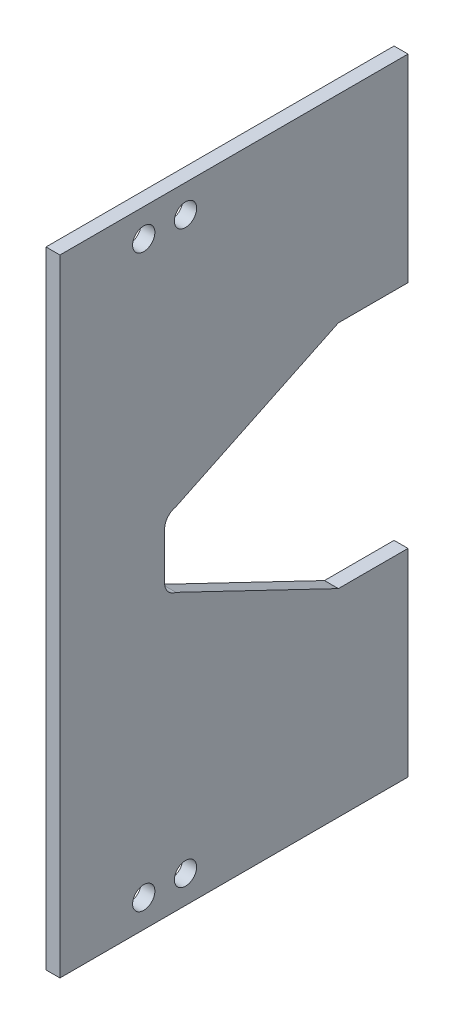
ISO-10303-21;
HEADER;
FILE_DESCRIPTION(('STEP AP214'),'2;1');
FILE_NAME('part.step','',(''),(''),'','','');
FILE_SCHEMA(('AUTOMOTIVE_DESIGN { 1 0 10303 214 1 1 1 1 }'));
ENDSEC;
DATA;
#1=APPLICATION_CONTEXT('core data for automotive mechanical design processes');
#2=APPLICATION_PROTOCOL_DEFINITION('international standard','automotive_design',2000,#1);
#3=PRODUCT_CONTEXT('',#1,'mechanical');
#4=PRODUCT('Part','Part','',(#3));
#5=PRODUCT_RELATED_PRODUCT_CATEGORY('part','',(#4));
#6=PRODUCT_DEFINITION_FORMATION('','',#4);
#7=PRODUCT_DEFINITION_CONTEXT('part definition',#1,'design');
#8=PRODUCT_DEFINITION('design','',#6,#7);
#9=PRODUCT_DEFINITION_SHAPE('','',#8);
#10=(LENGTH_UNIT() NAMED_UNIT(*) SI_UNIT(.MILLI.,.METRE.));
#11=(NAMED_UNIT(*) PLANE_ANGLE_UNIT() SI_UNIT($,.RADIAN.));
#12=(NAMED_UNIT(*) SI_UNIT($,.STERADIAN.) SOLID_ANGLE_UNIT());
#13=UNCERTAINTY_MEASURE_WITH_UNIT(LENGTH_MEASURE(1.E-05),#10,'distance_accuracy_value','');
#14=(GEOMETRIC_REPRESENTATION_CONTEXT(3) GLOBAL_UNCERTAINTY_ASSIGNED_CONTEXT((#13)) GLOBAL_UNIT_ASSIGNED_CONTEXT((#10,
#11,#12)) REPRESENTATION_CONTEXT('',''));
#15=CARTESIAN_POINT('',(0.,0.,0.));
#16=DIRECTION('',(0.,0.,1.));
#17=DIRECTION('',(1.,0.,0.));
#18=AXIS2_PLACEMENT_3D('',#15,#16,#17);
#19=CARTESIAN_POINT('',(1.20625,-10.795,3.));
#20=DIRECTION('',(0.,1.,0.));
#21=DIRECTION('',(0.,0.,1.));
#22=AXIS2_PLACEMENT_3D('',#19,#20,#21);
#23=PLANE('',#22);
#24=DIRECTION('',(0.,0.,-1.));
#25=VECTOR('',#24,1.);
#26=CARTESIAN_POINT('',(-0.793750000000003,-10.795,3.));
#27=LINE('',#26,#25);
#28=CARTESIAN_POINT('',(-0.793750000000006,-10.795,15.));
#29=VERTEX_POINT('',#28);
#30=CARTESIAN_POINT('',(-0.793749999999991,-10.795,-35.));
#31=VERTEX_POINT('',#30);
#32=EDGE_CURVE('E246',#29,#31,#27,.T.);
#33=ORIENTED_EDGE('',*,*,#32,.F.);
#34=DIRECTION('',(-1.,0.,0.));
#35=VECTOR('',#34,1.);
#36=CARTESIAN_POINT('',(1.20624999999999,-10.795,15.));
#37=LINE('',#36,#35);
#38=CARTESIAN_POINT('',(1.20624999999999,-10.795,15.));
#39=VERTEX_POINT('',#38);
#40=EDGE_CURVE('E140',#39,#29,#37,.T.);
#41=ORIENTED_EDGE('',*,*,#40,.F.);
#42=DIRECTION('',(0.,0.,-1.));
#43=VECTOR('',#42,1.);
#44=CARTESIAN_POINT('',(1.20625,-10.795,3.));
#45=LINE('',#44,#43);
#46=CARTESIAN_POINT('',(1.20625000000001,-10.795,-35.));
#47=VERTEX_POINT('',#46);
#48=EDGE_CURVE('E135',#39,#47,#45,.T.);
#49=ORIENTED_EDGE('',*,*,#48,.T.);
#50=DIRECTION('',(-1.,0.,0.));
#51=VECTOR('',#50,1.);
#52=CARTESIAN_POINT('',(1.20625000000001,-10.795,-35.));
#53=LINE('',#52,#51);
#54=EDGE_CURVE('E137',#47,#31,#53,.T.);
#55=ORIENTED_EDGE('',*,*,#54,.T.);
#56=EDGE_LOOP('',(#33,#41,#49,#55));
#57=FACE_BOUND('',#56,.T.);
#58=ADVANCED_FACE('F39',(#57),#23,.T.);
#59=CARTESIAN_POINT('',(1.20625,-100.745,3.));
#60=DIRECTION('',(0.,-1.,0.));
#61=DIRECTION('',(0.,0.,-1.));
#62=AXIS2_PLACEMENT_3D('',#59,#60,#61);
#63=PLANE('',#62);
#64=DIRECTION('',(0.,0.,1.));
#65=VECTOR('',#64,1.);
#66=CARTESIAN_POINT('',(-0.793750000000003,-100.745,3.));
#67=LINE('',#66,#65);
#68=CARTESIAN_POINT('',(-0.793749999999991,-100.745,-35.));
#69=VERTEX_POINT('',#68);
#70=CARTESIAN_POINT('',(-0.793750000000006,-100.745,15.));
#71=VERTEX_POINT('',#70);
#72=EDGE_CURVE('E252',#69,#71,#67,.T.);
#73=ORIENTED_EDGE('',*,*,#72,.F.);
#74=DIRECTION('',(-1.,0.,0.));
#75=VECTOR('',#74,1.);
#76=CARTESIAN_POINT('',(1.20625000000001,-100.745,-35.));
#77=LINE('',#76,#75);
#78=CARTESIAN_POINT('',(1.20625000000001,-100.745,-35.));
#79=VERTEX_POINT('',#78);
#80=EDGE_CURVE('E192',#79,#69,#77,.T.);
#81=ORIENTED_EDGE('',*,*,#80,.F.);
#82=DIRECTION('',(0.,0.,1.));
#83=VECTOR('',#82,1.);
#84=CARTESIAN_POINT('',(1.20625,-100.745,3.));
#85=LINE('',#84,#83);
#86=CARTESIAN_POINT('',(1.20624999999999,-100.745,15.));
#87=VERTEX_POINT('',#86);
#88=EDGE_CURVE('E146',#79,#87,#85,.T.);
#89=ORIENTED_EDGE('',*,*,#88,.T.);
#90=DIRECTION('',(-1.,0.,0.));
#91=VECTOR('',#90,1.);
#92=CARTESIAN_POINT('',(1.20624999999999,-100.745,15.));
#93=LINE('',#92,#91);
#94=EDGE_CURVE('E236',#87,#71,#93,.T.);
#95=ORIENTED_EDGE('',*,*,#94,.T.);
#96=EDGE_LOOP('',(#73,#81,#89,#95));
#97=FACE_BOUND('',#96,.T.);
#98=ADVANCED_FACE('F331',(#97),#63,.T.);
#99=CARTESIAN_POINT('',(1.20625,-55.77,-0.0391447555514948));
#100=DIRECTION('',(0.,0.,-1.));
#101=DIRECTION('',(-1.,0.,0.));
#102=AXIS2_PLACEMENT_3D('',#99,#100,#101);
#103=PLANE('',#102);
#104=DIRECTION('',(0.,-1.,0.));
#105=VECTOR('',#104,1.);
#106=CARTESIAN_POINT('',(1.20625,-55.77,-0.0391447555514948));
#107=LINE('',#106,#105);
#108=CARTESIAN_POINT('',(1.20625,-52.4114543338415,-0.0391447555514952));
#109=VERTEX_POINT('',#108);
#110=CARTESIAN_POINT('',(1.20625,-59.1285456661585,-0.0391447555514944));
#111=VERTEX_POINT('',#110);
#112=EDGE_CURVE('E243',#109,#111,#107,.T.);
#113=ORIENTED_EDGE('',*,*,#112,.T.);
#114=DIRECTION('',(-1.,0.,0.));
#115=VECTOR('',#114,1.);
#116=CARTESIAN_POINT('',(-0.793750000000001,-59.1285456661585,-0.0391447555514954));
#117=LINE('',#116,#115);
#118=CARTESIAN_POINT('',(-0.793750000000002,-59.1285456661585,-0.0391447555514954));
#119=VERTEX_POINT('',#118);
#120=EDGE_CURVE('E268',#111,#119,#117,.T.);
#121=ORIENTED_EDGE('',*,*,#120,.T.);
#122=DIRECTION('',(0.,-1.,0.));
#123=VECTOR('',#122,1.);
#124=CARTESIAN_POINT('',(-0.793750000000002,-55.77,-0.0391447555514954));
#125=LINE('',#124,#123);
#126=CARTESIAN_POINT('',(-0.793750000000002,-52.4114543338415,-0.0391447555514954));
#127=VERTEX_POINT('',#126);
#128=EDGE_CURVE('E240',#127,#119,#125,.T.);
#129=ORIENTED_EDGE('',*,*,#128,.F.);
#130=DIRECTION('',(-1.,0.,0.));
#131=VECTOR('',#130,1.);
#132=CARTESIAN_POINT('',(1.20625,-52.4114543338415,-0.0391447555514948));
#133=LINE('',#132,#131);
#134=EDGE_CURVE('E259',#127,#109,#133,.F.);
#135=ORIENTED_EDGE('',*,*,#134,.T.);
#136=EDGE_LOOP('',(#113,#121,#129,#135));
#137=FACE_BOUND('',#136,.T.);
#138=ADVANCED_FACE('F319',(#137),#103,.T.);
#139=CARTESIAN_POINT('',(1.20625,-12.795,-13.));
#140=DIRECTION('',(-1.,0.,0.));
#141=DIRECTION('',(0.,0.,1.));
#142=AXIS2_PLACEMENT_3D('',#139,#140,#141);
#143=PLANE('',#142);
#144=CARTESIAN_POINT('',(1.20625,-96.745,2.9608552444485));
#145=DIRECTION('',(1.,0.,0.));
#146=DIRECTION('',(0.,0.,1.));
#147=AXIS2_PLACEMENT_3D('',#144,#145,#146);
#148=CIRCLE('',#147,1.6);
#149=CARTESIAN_POINT('',(1.20625,-96.745,4.56085524444851));
#150=VERTEX_POINT('',#149);
#151=EDGE_CURVE('E196',#150,#150,#148,.T.);
#152=ORIENTED_EDGE('',*,*,#151,.F.);
#153=EDGE_LOOP('',(#152));
#154=FACE_BOUND('',#153,.T.);
#155=CARTESIAN_POINT('',(1.20625,-96.745,-3.0391447555515));
#156=DIRECTION('',(1.,0.,0.));
#157=DIRECTION('',(0.,0.,1.));
#158=AXIS2_PLACEMENT_3D('',#155,#156,#157);
#159=CIRCLE('',#158,1.6);
#160=CARTESIAN_POINT('',(1.20625,-96.745,-1.43914475555149));
#161=VERTEX_POINT('',#160);
#162=EDGE_CURVE('E204',#161,#161,#159,.T.);
#163=ORIENTED_EDGE('',*,*,#162,.F.);
#164=EDGE_LOOP('',(#163));
#165=FACE_BOUND('',#164,.T.);
#166=CARTESIAN_POINT('',(1.20625,-14.795,-3.0391447555515));
#167=DIRECTION('',(1.,0.,0.));
#168=DIRECTION('',(0.,0.,-1.));
#169=AXIS2_PLACEMENT_3D('',#166,#167,#168);
#170=CIRCLE('',#169,1.6);
#171=CARTESIAN_POINT('',(1.20625,-14.795,-4.6391447555515));
#172=VERTEX_POINT('',#171);
#173=EDGE_CURVE('E199',#172,#172,#170,.T.);
#174=ORIENTED_EDGE('',*,*,#173,.F.);
#175=EDGE_LOOP('',(#174));
#176=FACE_BOUND('',#175,.T.);
#177=CARTESIAN_POINT('',(1.20625,-14.795,2.9608552444485));
#178=DIRECTION('',(1.,0.,0.));
#179=DIRECTION('',(0.,0.,-1.));
#180=AXIS2_PLACEMENT_3D('',#177,#178,#179);
#181=CIRCLE('',#180,1.6);
#182=CARTESIAN_POINT('',(1.20625,-14.795,1.3608552444485));
#183=VERTEX_POINT('',#182);
#184=EDGE_CURVE('E203',#183,#183,#181,.T.);
#185=ORIENTED_EDGE('',*,*,#184,.F.);
#186=EDGE_LOOP('',(#185));
#187=FACE_BOUND('',#186,.T.);
#188=CARTESIAN_POINT('',(1.20625,-52.4114543338415,-2.03914475555149));
#189=DIRECTION('',(-1.,0.,0.));
#190=DIRECTION('',(0.,0.,1.));
#191=AXIS2_PLACEMENT_3D('',#188,#189,#190);
#192=CIRCLE('',#191,2.);
#193=CARTESIAN_POINT('',(1.20625,-50.4498612190227,-1.64907751532796));
#194=VERTEX_POINT('',#193);
#195=EDGE_CURVE('E265',#109,#194,#192,.T.);
#196=ORIENTED_EDGE('',*,*,#195,.T.);
#197=DIRECTION('',(0.,-0.432718299890711,0.901529185850182));
#198=VECTOR('',#197,1.);
#199=CARTESIAN_POINT('',(1.20625,-50.4498612190227,-1.64907751532796));
#200=LINE('',#199,#198);
#201=CARTESIAN_POINT('',(1.20625000000001,-39.2418253206417,-25.));
#202=VERTEX_POINT('',#201);
#203=EDGE_CURVE('E215',#202,#194,#200,.T.);
#204=ORIENTED_EDGE('',*,*,#203,.F.);
#205=DIRECTION('',(0.,0.,1.));
#206=VECTOR('',#205,1.);
#207=CARTESIAN_POINT('',(1.20625000000001,-39.2418253206417,-35.));
#208=LINE('',#207,#206);
#209=CARTESIAN_POINT('',(1.20625000000001,-39.2418253206417,-35.));
#210=VERTEX_POINT('',#209);
#211=EDGE_CURVE('E157',#210,#202,#208,.T.);
#212=ORIENTED_EDGE('',*,*,#211,.F.);
#213=DIRECTION('',(0.,-1.,0.));
#214=VECTOR('',#213,1.);
#215=CARTESIAN_POINT('',(1.20625000000001,-10.795,-35.));
#216=LINE('',#215,#214);
#217=EDGE_CURVE('E151',#47,#210,#216,.T.);
#218=ORIENTED_EDGE('',*,*,#217,.F.);
#219=ORIENTED_EDGE('',*,*,#48,.F.);
#220=DIRECTION('',(0.,1.,0.));
#221=VECTOR('',#220,1.);
#222=CARTESIAN_POINT('',(1.20624999999999,-10.795,15.));
#223=LINE('',#222,#221);
#224=EDGE_CURVE('E230',#87,#39,#223,.T.);
#225=ORIENTED_EDGE('',*,*,#224,.F.);
#226=ORIENTED_EDGE('',*,*,#88,.F.);
#227=DIRECTION('',(0.,-1.,0.));
#228=VECTOR('',#227,1.);
#229=CARTESIAN_POINT('',(1.20625000000001,-100.745,-35.));
#230=LINE('',#229,#228);
#231=CARTESIAN_POINT('',(1.20625000000001,-72.2981746793583,-35.));
#232=VERTEX_POINT('',#231);
#233=EDGE_CURVE('E180',#232,#79,#230,.T.);
#234=ORIENTED_EDGE('',*,*,#233,.F.);
#235=DIRECTION('',(0.,0.,-1.));
#236=VECTOR('',#235,1.);
#237=CARTESIAN_POINT('',(1.20625000000001,-72.2981746793583,-35.));
#238=LINE('',#237,#236);
#239=CARTESIAN_POINT('',(1.20625000000001,-72.2981746793583,-25.));
#240=VERTEX_POINT('',#239);
#241=EDGE_CURVE('E176',#240,#232,#238,.T.);
#242=ORIENTED_EDGE('',*,*,#241,.F.);
#243=DIRECTION('',(0.,-0.432718299890711,-0.901529185850182));
#244=VECTOR('',#243,1.);
#245=CARTESIAN_POINT('',(1.20625,-61.0901387809773,-1.64907751532796));
#246=LINE('',#245,#244);
#247=CARTESIAN_POINT('',(1.20625,-61.0901387809773,-1.64907751532796));
#248=VERTEX_POINT('',#247);
#249=EDGE_CURVE('E219',#248,#240,#246,.T.);
#250=ORIENTED_EDGE('',*,*,#249,.F.);
#251=CARTESIAN_POINT('',(1.20625,-59.1285456661585,-2.03914475555149));
#252=DIRECTION('',(-1.,0.,0.));
#253=DIRECTION('',(0.,0.,1.));
#254=AXIS2_PLACEMENT_3D('',#251,#252,#253);
#255=CIRCLE('',#254,2.);
#256=EDGE_CURVE('E57',#248,#111,#255,.T.);
#257=ORIENTED_EDGE('',*,*,#256,.T.);
#258=ORIENTED_EDGE('',*,*,#112,.F.);
#259=EDGE_LOOP('',(#196,#204,#212,#218,#219,#225,#226,#234,#242,#250,#257,#258));
#260=FACE_BOUND('',#259,.T.);
#261=ADVANCED_FACE('F160',(#154,#165,#176,#187,#260),#143,.F.);
#262=CARTESIAN_POINT('',(-0.793749999999998,-12.795,-13.));
#263=DIRECTION('',(-1.,0.,0.));
#264=DIRECTION('',(0.,0.,1.));
#265=AXIS2_PLACEMENT_3D('',#262,#263,#264);
#266=PLANE('',#265);
#267=CARTESIAN_POINT('',(-0.793750000000003,-96.745,2.9608552444485));
#268=DIRECTION('',(-1.,0.,0.));
#269=DIRECTION('',(0.,0.,1.));
#270=AXIS2_PLACEMENT_3D('',#267,#268,#269);
#271=CIRCLE('',#270,1.6);
#272=CARTESIAN_POINT('',(-0.793750000000003,-96.745,4.56085524444851));
#273=VERTEX_POINT('',#272);
#274=EDGE_CURVE('E43',#273,#273,#271,.T.);
#275=ORIENTED_EDGE('',*,*,#274,.F.);
#276=EDGE_LOOP('',(#275));
#277=FACE_BOUND('',#276,.T.);
#278=CARTESIAN_POINT('',(-0.793750000000001,-96.745,-3.0391447555515));
#279=DIRECTION('',(-1.,0.,0.));
#280=DIRECTION('',(0.,0.,1.));
#281=AXIS2_PLACEMENT_3D('',#278,#279,#280);
#282=CIRCLE('',#281,1.6);
#283=CARTESIAN_POINT('',(-0.793750000000002,-96.745,-1.43914475555149));
#284=VERTEX_POINT('',#283);
#285=EDGE_CURVE('E287',#284,#284,#282,.T.);
#286=ORIENTED_EDGE('',*,*,#285,.F.);
#287=EDGE_LOOP('',(#286));
#288=FACE_BOUND('',#287,.T.);
#289=CARTESIAN_POINT('',(-0.793750000000001,-14.795,-3.0391447555515));
#290=DIRECTION('',(-1.,0.,0.));
#291=DIRECTION('',(0.,0.,1.));
#292=AXIS2_PLACEMENT_3D('',#289,#290,#291);
#293=CIRCLE('',#292,1.6);
#294=CARTESIAN_POINT('',(-0.793750000000002,-14.795,-1.4391447555515));
#295=VERTEX_POINT('',#294);
#296=EDGE_CURVE('E284',#295,#295,#293,.T.);
#297=ORIENTED_EDGE('',*,*,#296,.F.);
#298=EDGE_LOOP('',(#297));
#299=FACE_BOUND('',#298,.T.);
#300=CARTESIAN_POINT('',(-0.793750000000003,-14.795,2.9608552444485));
#301=DIRECTION('',(-1.,0.,0.));
#302=DIRECTION('',(0.,0.,1.));
#303=AXIS2_PLACEMENT_3D('',#300,#301,#302);
#304=CIRCLE('',#303,1.6);
#305=CARTESIAN_POINT('',(-0.793750000000003,-14.795,4.5608552444485));
#306=VERTEX_POINT('',#305);
#307=EDGE_CURVE('E214',#306,#306,#304,.T.);
#308=ORIENTED_EDGE('',*,*,#307,.F.);
#309=EDGE_LOOP('',(#308));
#310=FACE_BOUND('',#309,.T.);
#311=DIRECTION('',(0.,0.432718299890711,-0.901529185850183));
#312=VECTOR('',#311,1.);
#313=CARTESIAN_POINT('',(-0.793749999999994,-38.9710842723718,-25.5640643274959));
#314=LINE('',#313,#312);
#315=CARTESIAN_POINT('',(-0.793750000000001,-50.4498612190227,-1.64907751532796));
#316=VERTEX_POINT('',#315);
#317=CARTESIAN_POINT('',(-0.793749999999994,-39.2418253206417,-25.));
#318=VERTEX_POINT('',#317);
#319=EDGE_CURVE('E225',#316,#318,#314,.T.);
#320=ORIENTED_EDGE('',*,*,#319,.F.);
#321=CARTESIAN_POINT('',(-0.793750000000001,-52.4114543338415,-2.03914475555149));
#322=DIRECTION('',(-1.,0.,0.));
#323=DIRECTION('',(0.,0.,1.));
#324=AXIS2_PLACEMENT_3D('',#321,#322,#323);
#325=CIRCLE('',#324,2.);
#326=EDGE_CURVE('E262',#316,#127,#325,.F.);
#327=ORIENTED_EDGE('',*,*,#326,.T.);
#328=ORIENTED_EDGE('',*,*,#128,.T.);
#329=CARTESIAN_POINT('',(-0.793750000000001,-59.1285456661585,-2.03914475555149));
#330=DIRECTION('',(-1.,0.,0.));
#331=DIRECTION('',(0.,0.,1.));
#332=AXIS2_PLACEMENT_3D('',#329,#330,#331);
#333=CIRCLE('',#332,2.);
#334=CARTESIAN_POINT('',(-0.793750000000001,-61.0901387809773,-1.64907751532796));
#335=VERTEX_POINT('',#334);
#336=EDGE_CURVE('E65',#119,#335,#333,.F.);
#337=ORIENTED_EDGE('',*,*,#336,.T.);
#338=DIRECTION('',(0.,0.432718299890711,0.901529185850182));
#339=VECTOR('',#338,1.);
#340=CARTESIAN_POINT('',(-0.793750000000004,-56.4751970567948,7.96573345152746));
#341=LINE('',#340,#339);
#342=CARTESIAN_POINT('',(-0.793749999999994,-72.2981746793583,-25.));
#343=VERTEX_POINT('',#342);
#344=EDGE_CURVE('E218',#343,#335,#341,.T.);
#345=ORIENTED_EDGE('',*,*,#344,.F.);
#346=DIRECTION('',(0.,0.,-1.));
#347=VECTOR('',#346,1.);
#348=CARTESIAN_POINT('',(-0.793749999999991,-72.2981746793583,-35.));
#349=LINE('',#348,#347);
#350=CARTESIAN_POINT('',(-0.793749999999991,-72.2981746793583,-35.));
#351=VERTEX_POINT('',#350);
#352=EDGE_CURVE('E174',#343,#351,#349,.T.);
#353=ORIENTED_EDGE('',*,*,#352,.T.);
#354=DIRECTION('',(0.,-1.,0.));
#355=VECTOR('',#354,1.);
#356=CARTESIAN_POINT('',(-0.793749999999991,-100.745,-35.));
#357=LINE('',#356,#355);
#358=EDGE_CURVE('E181',#351,#69,#357,.T.);
#359=ORIENTED_EDGE('',*,*,#358,.T.);
#360=ORIENTED_EDGE('',*,*,#72,.T.);
#361=DIRECTION('',(0.,1.,0.));
#362=VECTOR('',#361,1.);
#363=CARTESIAN_POINT('',(-0.793750000000006,-10.795,15.));
#364=LINE('',#363,#362);
#365=EDGE_CURVE('E229',#71,#29,#364,.T.);
#366=ORIENTED_EDGE('',*,*,#365,.T.);
#367=ORIENTED_EDGE('',*,*,#32,.T.);
#368=DIRECTION('',(0.,-1.,0.));
#369=VECTOR('',#368,1.);
#370=CARTESIAN_POINT('',(-0.793749999999991,-10.795,-35.));
#371=LINE('',#370,#369);
#372=CARTESIAN_POINT('',(-0.793749999999991,-39.2418253206417,-35.));
#373=VERTEX_POINT('',#372);
#374=EDGE_CURVE('E154',#31,#373,#371,.T.);
#375=ORIENTED_EDGE('',*,*,#374,.T.);
#376=DIRECTION('',(0.,0.,1.));
#377=VECTOR('',#376,1.);
#378=CARTESIAN_POINT('',(-0.793749999999991,-39.2418253206417,-35.));
#379=LINE('',#378,#377);
#380=EDGE_CURVE('E163',#373,#318,#379,.T.);
#381=ORIENTED_EDGE('',*,*,#380,.T.);
#382=EDGE_LOOP('',(#320,#327,#328,#337,#345,#353,#359,#360,#366,#367,#375,#381));
#383=FACE_BOUND('',#382,.T.);
#384=ADVANCED_FACE('F299',(#277,#288,#299,#310,#383),#266,.T.);
#385=CARTESIAN_POINT('',(1.20625,-52.4114543338415,-2.03914475555149));
#386=DIRECTION('',(1.,0.,0.));
#387=DIRECTION('',(0.,0.,-1.));
#388=AXIS2_PLACEMENT_3D('',#385,#386,#387);
#389=CYLINDRICAL_SURFACE('',#388,2.);
#390=ORIENTED_EDGE('',*,*,#195,.F.);
#391=ORIENTED_EDGE('',*,*,#134,.F.);
#392=ORIENTED_EDGE('',*,*,#326,.F.);
#393=DIRECTION('',(-1.,0.,0.));
#394=VECTOR('',#393,1.);
#395=CARTESIAN_POINT('',(-0.793750000000001,-50.4498612190227,-1.64907751532796));
#396=LINE('',#395,#394);
#397=EDGE_CURVE('E145',#194,#316,#396,.T.);
#398=ORIENTED_EDGE('',*,*,#397,.F.);
#399=EDGE_LOOP('',(#390,#391,#392,#398));
#400=FACE_BOUND('',#399,.T.);
#401=ADVANCED_FACE('F302',(#400),#389,.F.);
#402=CARTESIAN_POINT('',(1.20625,-59.1285456661585,-2.03914475555149));
#403=DIRECTION('',(1.,0.,0.));
#404=DIRECTION('',(0.,0.,-1.));
#405=AXIS2_PLACEMENT_3D('',#402,#403,#404);
#406=CYLINDRICAL_SURFACE('',#405,2.);
#407=ORIENTED_EDGE('',*,*,#256,.F.);
#408=DIRECTION('',(-1.,0.,0.));
#409=VECTOR('',#408,1.);
#410=CARTESIAN_POINT('',(1.20625,-61.0901387809773,-1.64907751532796));
#411=LINE('',#410,#409);
#412=EDGE_CURVE('E271',#335,#248,#411,.F.);
#413=ORIENTED_EDGE('',*,*,#412,.F.);
#414=ORIENTED_EDGE('',*,*,#336,.F.);
#415=ORIENTED_EDGE('',*,*,#120,.F.);
#416=EDGE_LOOP('',(#407,#413,#414,#415));
#417=FACE_BOUND('',#416,.T.);
#418=ADVANCED_FACE('F41',(#417),#406,.F.);
#419=CARTESIAN_POINT('',(1.20624999999999,-10.795,15.));
#420=DIRECTION('',(0.,0.,1.));
#421=DIRECTION('',(1.,0.,0.));
#422=AXIS2_PLACEMENT_3D('',#419,#420,#421);
#423=PLANE('',#422);
#424=ORIENTED_EDGE('',*,*,#365,.F.);
#425=ORIENTED_EDGE('',*,*,#94,.F.);
#426=ORIENTED_EDGE('',*,*,#224,.T.);
#427=ORIENTED_EDGE('',*,*,#40,.T.);
#428=EDGE_LOOP('',(#424,#425,#426,#427));
#429=FACE_BOUND('',#428,.T.);
#430=ADVANCED_FACE('F325',(#429),#423,.T.);
#431=CARTESIAN_POINT('',(-8.79375,-61.0901387809773,-1.64907751532796));
#432=DIRECTION('',(0.,-0.901529185850182,0.432718299890711));
#433=DIRECTION('',(0.,-0.432718299890711,-0.901529185850182));
#434=AXIS2_PLACEMENT_3D('',#431,#432,#433);
#435=PLANE('',#434);
#436=ORIENTED_EDGE('',*,*,#344,.T.);
#437=ORIENTED_EDGE('',*,*,#412,.T.);
#438=ORIENTED_EDGE('',*,*,#249,.T.);
#439=DIRECTION('',(-1.,0.,0.));
#440=VECTOR('',#439,1.);
#441=CARTESIAN_POINT('',(1.20625000000001,-72.2981746793583,-25.));
#442=LINE('',#441,#440);
#443=EDGE_CURVE('E49',#240,#343,#442,.T.);
#444=ORIENTED_EDGE('',*,*,#443,.T.);
#445=EDGE_LOOP('',(#436,#437,#438,#444));
#446=FACE_BOUND('',#445,.T.);
#447=ADVANCED_FACE('F338',(#446),#435,.F.);
#448=CARTESIAN_POINT('',(-8.79375,-50.4498612190227,-1.64907751532796));
#449=DIRECTION('',(0.,0.901529185850182,0.432718299890711));
#450=DIRECTION('',(0.,-0.432718299890711,0.901529185850183));
#451=AXIS2_PLACEMENT_3D('',#448,#449,#450);
#452=PLANE('',#451);
#453=ORIENTED_EDGE('',*,*,#319,.T.);
#454=DIRECTION('',(1.,0.,0.));
#455=VECTOR('',#454,1.);
#456=CARTESIAN_POINT('',(1.20625000000001,-39.2418253206417,-25.));
#457=LINE('',#456,#455);
#458=EDGE_CURVE('E11',#318,#202,#457,.T.);
#459=ORIENTED_EDGE('',*,*,#458,.T.);
#460=ORIENTED_EDGE('',*,*,#203,.T.);
#461=ORIENTED_EDGE('',*,*,#397,.T.);
#462=EDGE_LOOP('',(#453,#459,#460,#461));
#463=FACE_BOUND('',#462,.T.);
#464=ADVANCED_FACE('F320',(#463),#452,.F.);
#465=CARTESIAN_POINT('',(-8.79375,-14.795,2.9608552444485));
#466=DIRECTION('',(1.,0.,0.));
#467=DIRECTION('',(0.,0.,-1.));
#468=AXIS2_PLACEMENT_3D('',#465,#466,#467);
#469=CYLINDRICAL_SURFACE('',#468,1.6);
#470=ORIENTED_EDGE('',*,*,#307,.T.);
#471=EDGE_LOOP('',(#470));
#472=FACE_BOUND('',#471,.T.);
#473=ORIENTED_EDGE('',*,*,#184,.T.);
#474=EDGE_LOOP('',(#473));
#475=FACE_BOUND('',#474,.T.);
#476=ADVANCED_FACE('F369',(#472,#475),#469,.F.);
#477=CARTESIAN_POINT('',(-8.79375,-14.795,-3.0391447555515));
#478=DIRECTION('',(1.,0.,0.));
#479=DIRECTION('',(0.,0.,-1.));
#480=AXIS2_PLACEMENT_3D('',#477,#478,#479);
#481=CYLINDRICAL_SURFACE('',#480,1.6);
#482=ORIENTED_EDGE('',*,*,#296,.T.);
#483=EDGE_LOOP('',(#482));
#484=FACE_BOUND('',#483,.T.);
#485=ORIENTED_EDGE('',*,*,#173,.T.);
#486=EDGE_LOOP('',(#485));
#487=FACE_BOUND('',#486,.T.);
#488=ADVANCED_FACE('F372',(#484,#487),#481,.F.);
#489=CARTESIAN_POINT('',(-8.79375,-96.745,-3.0391447555515));
#490=DIRECTION('',(1.,0.,0.));
#491=DIRECTION('',(0.,0.,-1.));
#492=AXIS2_PLACEMENT_3D('',#489,#490,#491);
#493=CYLINDRICAL_SURFACE('',#492,1.6);
#494=ORIENTED_EDGE('',*,*,#285,.T.);
#495=EDGE_LOOP('',(#494));
#496=FACE_BOUND('',#495,.T.);
#497=ORIENTED_EDGE('',*,*,#162,.T.);
#498=EDGE_LOOP('',(#497));
#499=FACE_BOUND('',#498,.T.);
#500=ADVANCED_FACE('F375',(#496,#499),#493,.F.);
#501=CARTESIAN_POINT('',(-8.79375,-96.745,2.9608552444485));
#502=DIRECTION('',(1.,0.,0.));
#503=DIRECTION('',(0.,0.,-1.));
#504=AXIS2_PLACEMENT_3D('',#501,#502,#503);
#505=CYLINDRICAL_SURFACE('',#504,1.6);
#506=ORIENTED_EDGE('',*,*,#274,.T.);
#507=EDGE_LOOP('',(#506));
#508=FACE_BOUND('',#507,.T.);
#509=ORIENTED_EDGE('',*,*,#151,.T.);
#510=EDGE_LOOP('',(#509));
#511=FACE_BOUND('',#510,.T.);
#512=ADVANCED_FACE('F296',(#508,#511),#505,.F.);
#513=CARTESIAN_POINT('',(1.20625000000001,-100.745,-35.));
#514=DIRECTION('',(0.,0.,-1.));
#515=DIRECTION('',(-1.,0.,0.));
#516=AXIS2_PLACEMENT_3D('',#513,#514,#515);
#517=PLANE('',#516);
#518=ORIENTED_EDGE('',*,*,#358,.F.);
#519=DIRECTION('',(-1.,0.,0.));
#520=VECTOR('',#519,1.);
#521=CARTESIAN_POINT('',(1.20625000000001,-72.2981746793583,-35.));
#522=LINE('',#521,#520);
#523=EDGE_CURVE('E185',#232,#351,#522,.T.);
#524=ORIENTED_EDGE('',*,*,#523,.F.);
#525=ORIENTED_EDGE('',*,*,#233,.T.);
#526=ORIENTED_EDGE('',*,*,#80,.T.);
#527=EDGE_LOOP('',(#518,#524,#525,#526));
#528=FACE_BOUND('',#527,.T.);
#529=ADVANCED_FACE('F334',(#528),#517,.T.);
#530=CARTESIAN_POINT('',(1.20625000000001,-72.2981746793583,-35.));
#531=DIRECTION('',(0.,1.,0.));
#532=DIRECTION('',(0.,0.,1.));
#533=AXIS2_PLACEMENT_3D('',#530,#531,#532);
#534=PLANE('',#533);
#535=ORIENTED_EDGE('',*,*,#352,.F.);
#536=ORIENTED_EDGE('',*,*,#443,.F.);
#537=ORIENTED_EDGE('',*,*,#241,.T.);
#538=ORIENTED_EDGE('',*,*,#523,.T.);
#539=EDGE_LOOP('',(#535,#536,#537,#538));
#540=FACE_BOUND('',#539,.T.);
#541=ADVANCED_FACE('F336',(#540),#534,.T.);
#542=CARTESIAN_POINT('',(1.20625000000001,-39.2418253206417,-35.));
#543=DIRECTION('',(0.,-1.,0.));
#544=DIRECTION('',(0.,0.,-1.));
#545=AXIS2_PLACEMENT_3D('',#542,#543,#544);
#546=PLANE('',#545);
#547=ORIENTED_EDGE('',*,*,#380,.F.);
#548=DIRECTION('',(-1.,0.,0.));
#549=VECTOR('',#548,1.);
#550=CARTESIAN_POINT('',(1.20625000000001,-39.2418253206417,-35.));
#551=LINE('',#550,#549);
#552=EDGE_CURVE('E156',#210,#373,#551,.T.);
#553=ORIENTED_EDGE('',*,*,#552,.F.);
#554=ORIENTED_EDGE('',*,*,#211,.T.);
#555=ORIENTED_EDGE('',*,*,#458,.F.);
#556=EDGE_LOOP('',(#547,#553,#554,#555));
#557=FACE_BOUND('',#556,.T.);
#558=ADVANCED_FACE('F322',(#557),#546,.T.);
#559=CARTESIAN_POINT('',(1.20625000000001,-10.795,-35.));
#560=DIRECTION('',(0.,0.,-1.));
#561=DIRECTION('',(-1.,0.,0.));
#562=AXIS2_PLACEMENT_3D('',#559,#560,#561);
#563=PLANE('',#562);
#564=ORIENTED_EDGE('',*,*,#374,.F.);
#565=ORIENTED_EDGE('',*,*,#54,.F.);
#566=ORIENTED_EDGE('',*,*,#217,.T.);
#567=ORIENTED_EDGE('',*,*,#552,.T.);
#568=EDGE_LOOP('',(#564,#565,#566,#567));
#569=FACE_BOUND('',#568,.T.);
#570=ADVANCED_FACE('F150',(#569),#563,.T.);
#571=CLOSED_SHELL('',(#58,#98,#138,#261,#384,#401,#418,#430,#447,#464,#476,#488,#500,#512,#529,
#541,#558,#570));
#572=MANIFOLD_SOLID_BREP('B2',#571);
#573=ADVANCED_BREP_SHAPE_REPRESENTATION('',(#18,#572),#14);
#574=SHAPE_DEFINITION_REPRESENTATION(#9,#573);
ENDSEC;
END-ISO-10303-21;
